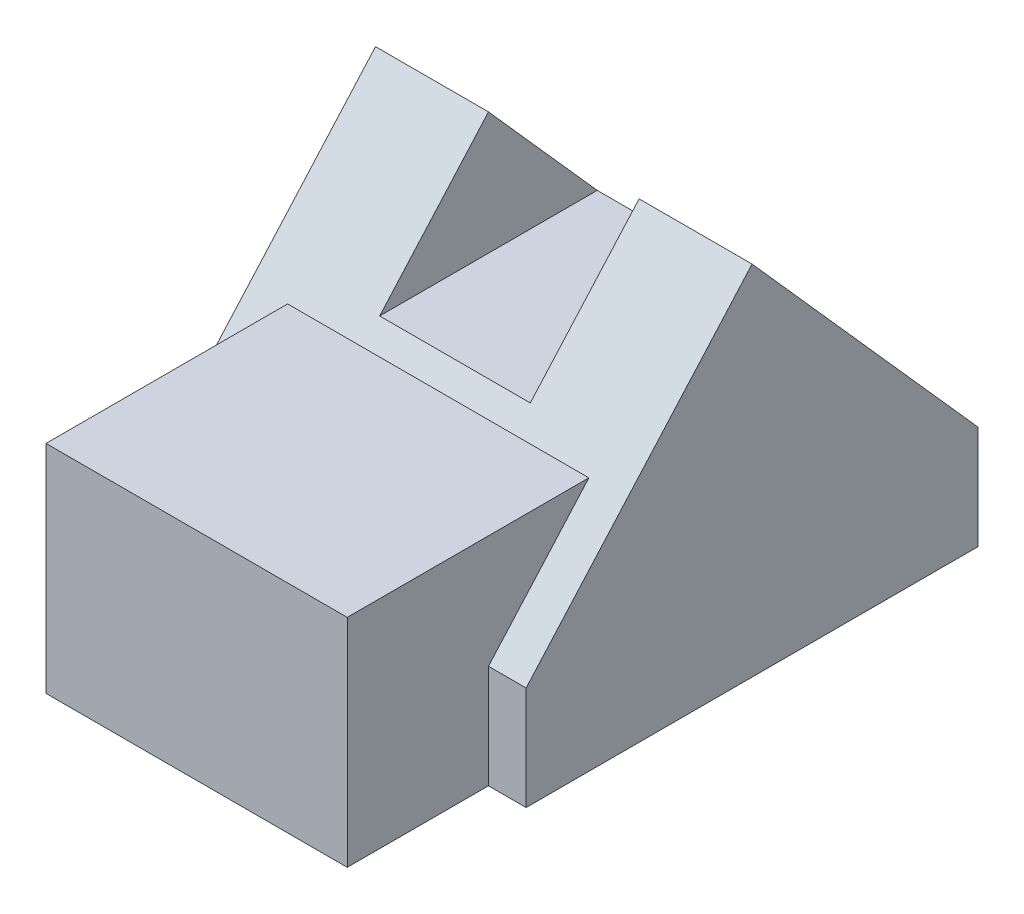
ISO-10303-21;
HEADER;
FILE_DESCRIPTION(('STEP AP214'),'2;1');
FILE_NAME('part.step','',(''),(''),'','','');
FILE_SCHEMA(('AUTOMOTIVE_DESIGN { 1 0 10303 214 1 1 1 1 }'));
ENDSEC;
DATA;
#1=APPLICATION_CONTEXT('core data for automotive mechanical design processes');
#2=APPLICATION_PROTOCOL_DEFINITION('international standard','automotive_design',2000,#1);
#3=PRODUCT_CONTEXT('',#1,'mechanical');
#4=PRODUCT('Part','Part','',(#3));
#5=PRODUCT_RELATED_PRODUCT_CATEGORY('part','',(#4));
#6=PRODUCT_DEFINITION_FORMATION('','',#4);
#7=PRODUCT_DEFINITION_CONTEXT('part definition',#1,'design');
#8=PRODUCT_DEFINITION('design','',#6,#7);
#9=PRODUCT_DEFINITION_SHAPE('','',#8);
#10=(LENGTH_UNIT() NAMED_UNIT(*) SI_UNIT(.MILLI.,.METRE.));
#11=(NAMED_UNIT(*) PLANE_ANGLE_UNIT() SI_UNIT($,.RADIAN.));
#12=(NAMED_UNIT(*) SI_UNIT($,.STERADIAN.) SOLID_ANGLE_UNIT());
#13=UNCERTAINTY_MEASURE_WITH_UNIT(LENGTH_MEASURE(1.E-05),#10,'distance_accuracy_value','');
#14=(GEOMETRIC_REPRESENTATION_CONTEXT(3) GLOBAL_UNCERTAINTY_ASSIGNED_CONTEXT((#13)) GLOBAL_UNIT_ASSIGNED_CONTEXT((#10,
#11,#12)) REPRESENTATION_CONTEXT('',''));
#15=CARTESIAN_POINT('',(0.,0.,0.));
#16=DIRECTION('',(0.,0.,1.));
#17=DIRECTION('',(1.,0.,0.));
#18=AXIS2_PLACEMENT_3D('',#15,#16,#17);
#19=CARTESIAN_POINT('',(0.,38.,0.));
#20=DIRECTION('',(1.,0.,0.));
#21=DIRECTION('',(0.,0.,-1.));
#22=AXIS2_PLACEMENT_3D('',#19,#20,#21);
#23=PLANE('',#22);
#24=DIRECTION('',(0.,1.,0.));
#25=VECTOR('',#24,1.);
#26=CARTESIAN_POINT('',(0.,0.,-15.));
#27=LINE('',#26,#25);
#28=CARTESIAN_POINT('',(0.,0.,-15.));
#29=VERTEX_POINT('',#28);
#30=CARTESIAN_POINT('',(0.,11.,-15.));
#31=VERTEX_POINT('',#30);
#32=EDGE_CURVE('E157',#29,#31,#27,.T.);
#33=ORIENTED_EDGE('',*,*,#32,.T.);
#34=DIRECTION('',(0.,0.74740931868366,-0.66436383882992));
#35=VECTOR('',#34,1.);
#36=CARTESIAN_POINT('',(0.,23.,-25.6666666666667));
#37=LINE('',#36,#35);
#38=CARTESIAN_POINT('',(0.,38.,-39.));
#39=VERTEX_POINT('',#38);
#40=EDGE_CURVE('E150',#31,#39,#37,.T.);
#41=ORIENTED_EDGE('',*,*,#40,.T.);
#42=DIRECTION('',(0.,0.74740931868366,0.66436383882992));
#43=VECTOR('',#42,1.);
#44=CARTESIAN_POINT('',(0.,57.3655172413793,-21.7862068965517));
#45=LINE('',#44,#43);
#46=CARTESIAN_POINT('',(0.,11.,-63.));
#47=VERTEX_POINT('',#46);
#48=EDGE_CURVE('E248',#47,#39,#45,.T.);
#49=ORIENTED_EDGE('',*,*,#48,.F.);
#50=DIRECTION('',(0.,-1.,0.));
#51=VECTOR('',#50,1.);
#52=CARTESIAN_POINT('',(0.,38.,-63.));
#53=LINE('',#52,#51);
#54=CARTESIAN_POINT('',(0.,0.,-63.));
#55=VERTEX_POINT('',#54);
#56=EDGE_CURVE('E204',#47,#55,#53,.T.);
#57=ORIENTED_EDGE('',*,*,#56,.T.);
#58=DIRECTION('',(0.,0.,1.));
#59=VECTOR('',#58,1.);
#60=CARTESIAN_POINT('',(0.,0.,0.));
#61=LINE('',#60,#59);
#62=EDGE_CURVE('E162',#55,#29,#61,.T.);
#63=ORIENTED_EDGE('',*,*,#62,.T.);
#64=EDGE_LOOP('',(#33,#41,#49,#57,#63));
#65=FACE_BOUND('',#64,.T.);
#66=ADVANCED_FACE('F39',(#65),#23,.F.);
#67=CARTESIAN_POINT('',(0.,0.,-15.));
#68=DIRECTION('',(0.,0.,-1.));
#69=DIRECTION('',(-1.,0.,0.));
#70=AXIS2_PLACEMENT_3D('',#67,#68,#69);
#71=PLANE('',#70);
#72=DIRECTION('',(-1.,0.,0.));
#73=VECTOR('',#72,1.);
#74=CARTESIAN_POINT('',(4.,11.,-15.));
#75=LINE('',#74,#73);
#76=CARTESIAN_POINT('',(4.,11.,-15.));
#77=VERTEX_POINT('',#76);
#78=EDGE_CURVE('E145',#77,#31,#75,.T.);
#79=ORIENTED_EDGE('',*,*,#78,.T.);
#80=ORIENTED_EDGE('',*,*,#32,.F.);
#81=DIRECTION('',(-1.,0.,0.));
#82=VECTOR('',#81,1.);
#83=CARTESIAN_POINT('',(0.,0.,-15.));
#84=LINE('',#83,#82);
#85=CARTESIAN_POINT('',(4.,0.,-15.));
#86=VERTEX_POINT('',#85);
#87=EDGE_CURVE('E62',#86,#29,#84,.T.);
#88=ORIENTED_EDGE('',*,*,#87,.F.);
#89=DIRECTION('',(0.,1.,0.));
#90=VECTOR('',#89,1.);
#91=CARTESIAN_POINT('',(4.,0.,-15.));
#92=LINE('',#91,#90);
#93=EDGE_CURVE('E138',#86,#77,#92,.T.);
#94=ORIENTED_EDGE('',*,*,#93,.T.);
#95=EDGE_LOOP('',(#79,#80,#88,#94));
#96=FACE_BOUND('',#95,.T.);
#97=ADVANCED_FACE('F155',(#96),#71,.F.);
#98=CARTESIAN_POINT('',(0.,38.,0.));
#99=DIRECTION('',(0.,0.,-1.));
#100=DIRECTION('',(-1.,0.,0.));
#101=AXIS2_PLACEMENT_3D('',#98,#99,#100);
#102=PLANE('',#101);
#103=DIRECTION('',(0.,1.,0.));
#104=VECTOR('',#103,1.);
#105=CARTESIAN_POINT('',(36.,0.,0.));
#106=LINE('',#105,#104);
#107=CARTESIAN_POINT('',(36.,0.,0.));
#108=VERTEX_POINT('',#107);
#109=CARTESIAN_POINT('',(36.,23.,0.));
#110=VERTEX_POINT('',#109);
#111=EDGE_CURVE('E177',#108,#110,#106,.T.);
#112=ORIENTED_EDGE('',*,*,#111,.T.);
#113=DIRECTION('',(1.,0.,0.));
#114=VECTOR('',#113,1.);
#115=CARTESIAN_POINT('',(0.,23.,0.));
#116=LINE('',#115,#114);
#117=CARTESIAN_POINT('',(4.,23.,0.));
#118=VERTEX_POINT('',#117);
#119=EDGE_CURVE('E269',#118,#110,#116,.T.);
#120=ORIENTED_EDGE('',*,*,#119,.F.);
#121=DIRECTION('',(0.,1.,0.));
#122=VECTOR('',#121,1.);
#123=CARTESIAN_POINT('',(4.,0.,0.));
#124=LINE('',#123,#122);
#125=CARTESIAN_POINT('',(4.,0.,0.));
#126=VERTEX_POINT('',#125);
#127=EDGE_CURVE('E158',#126,#118,#124,.T.);
#128=ORIENTED_EDGE('',*,*,#127,.F.);
#129=DIRECTION('',(1.,0.,0.));
#130=VECTOR('',#129,1.);
#131=CARTESIAN_POINT('',(0.,0.,0.));
#132=LINE('',#131,#130);
#133=EDGE_CURVE('E192',#126,#108,#132,.T.);
#134=ORIENTED_EDGE('',*,*,#133,.T.);
#135=EDGE_LOOP('',(#112,#120,#128,#134));
#136=FACE_BOUND('',#135,.T.);
#137=ADVANCED_FACE('F266',(#136),#102,.F.);
#138=CARTESIAN_POINT('',(40.,38.,0.));
#139=DIRECTION('',(-1.,0.,0.));
#140=DIRECTION('',(0.,0.,1.));
#141=AXIS2_PLACEMENT_3D('',#138,#139,#140);
#142=PLANE('',#141);
#143=DIRECTION('',(0.,-1.,0.));
#144=VECTOR('',#143,1.);
#145=CARTESIAN_POINT('',(40.,38.,-63.));
#146=LINE('',#145,#144);
#147=CARTESIAN_POINT('',(40.,11.,-63.));
#148=VERTEX_POINT('',#147);
#149=CARTESIAN_POINT('',(40.,0.,-63.));
#150=VERTEX_POINT('',#149);
#151=EDGE_CURVE('E207',#148,#150,#146,.T.);
#152=ORIENTED_EDGE('',*,*,#151,.F.);
#153=DIRECTION('',(0.,-0.74740931868366,-0.66436383882992));
#154=VECTOR('',#153,1.);
#155=CARTESIAN_POINT('',(40.,36.1379310344828,-40.6551724137931));
#156=LINE('',#155,#154);
#157=CARTESIAN_POINT('',(40.,38.,-39.));
#158=VERTEX_POINT('',#157);
#159=EDGE_CURVE('E288',#158,#148,#156,.T.);
#160=ORIENTED_EDGE('',*,*,#159,.F.);
#161=DIRECTION('',(0.,0.74740931868366,-0.66436383882992));
#162=VECTOR('',#161,1.);
#163=CARTESIAN_POINT('',(40.,-2.59310344827586,-2.91724137931034));
#164=LINE('',#163,#162);
#165=CARTESIAN_POINT('',(40.,11.,-15.));
#166=VERTEX_POINT('',#165);
#167=EDGE_CURVE('E226',#166,#158,#164,.T.);
#168=ORIENTED_EDGE('',*,*,#167,.F.);
#169=DIRECTION('',(0.,1.,0.));
#170=VECTOR('',#169,1.);
#171=CARTESIAN_POINT('',(40.,0.,-15.));
#172=LINE('',#171,#170);
#173=CARTESIAN_POINT('',(40.,0.,-15.));
#174=VERTEX_POINT('',#173);
#175=EDGE_CURVE('E176',#174,#166,#172,.T.);
#176=ORIENTED_EDGE('',*,*,#175,.F.);
#177=DIRECTION('',(0.,0.,-1.));
#178=VECTOR('',#177,1.);
#179=CARTESIAN_POINT('',(40.,0.,0.));
#180=LINE('',#179,#178);
#181=EDGE_CURVE('E196',#174,#150,#180,.T.);
#182=ORIENTED_EDGE('',*,*,#181,.T.);
#183=EDGE_LOOP('',(#152,#160,#168,#176,#182));
#184=FACE_BOUND('',#183,.T.);
#185=ADVANCED_FACE('F256',(#184),#142,.F.);
#186=CARTESIAN_POINT('',(0.,38.,-63.));
#187=DIRECTION('',(0.,0.,1.));
#188=DIRECTION('',(1.,0.,0.));
#189=AXIS2_PLACEMENT_3D('',#186,#187,#188);
#190=PLANE('',#189);
#191=ORIENTED_EDGE('',*,*,#56,.F.);
#192=DIRECTION('',(1.,0.,0.));
#193=VECTOR('',#192,1.);
#194=CARTESIAN_POINT('',(36.,11.,-63.));
#195=LINE('',#194,#193);
#196=EDGE_CURVE('E290',#47,#148,#195,.T.);
#197=ORIENTED_EDGE('',*,*,#196,.T.);
#198=ORIENTED_EDGE('',*,*,#151,.T.);
#199=DIRECTION('',(-1.,0.,0.));
#200=VECTOR('',#199,1.);
#201=CARTESIAN_POINT('',(0.,0.,-63.));
#202=LINE('',#201,#200);
#203=EDGE_CURVE('E200',#150,#55,#202,.T.);
#204=ORIENTED_EDGE('',*,*,#203,.T.);
#205=EDGE_LOOP('',(#191,#197,#198,#204));
#206=FACE_BOUND('',#205,.T.);
#207=ADVANCED_FACE('F251',(#206),#190,.F.);
#208=CARTESIAN_POINT('',(0.,0.,0.));
#209=DIRECTION('',(0.,-1.,0.));
#210=DIRECTION('',(0.,0.,-1.));
#211=AXIS2_PLACEMENT_3D('',#208,#209,#210);
#212=PLANE('',#211);
#213=ORIENTED_EDGE('',*,*,#87,.T.);
#214=ORIENTED_EDGE('',*,*,#62,.F.);
#215=ORIENTED_EDGE('',*,*,#203,.F.);
#216=ORIENTED_EDGE('',*,*,#181,.F.);
#217=DIRECTION('',(-1.,0.,0.));
#218=VECTOR('',#217,1.);
#219=CARTESIAN_POINT('',(40.,0.,-15.));
#220=LINE('',#219,#218);
#221=CARTESIAN_POINT('',(36.,0.,-15.));
#222=VERTEX_POINT('',#221);
#223=EDGE_CURVE('E167',#174,#222,#220,.T.);
#224=ORIENTED_EDGE('',*,*,#223,.T.);
#225=DIRECTION('',(0.,0.,1.));
#226=VECTOR('',#225,1.);
#227=CARTESIAN_POINT('',(36.,0.,-15.));
#228=LINE('',#227,#226);
#229=EDGE_CURVE('E171',#222,#108,#228,.T.);
#230=ORIENTED_EDGE('',*,*,#229,.T.);
#231=ORIENTED_EDGE('',*,*,#133,.F.);
#232=DIRECTION('',(0.,0.,-1.));
#233=VECTOR('',#232,1.);
#234=CARTESIAN_POINT('',(4.,0.,-15.));
#235=LINE('',#234,#233);
#236=EDGE_CURVE('E181',#126,#86,#235,.T.);
#237=ORIENTED_EDGE('',*,*,#236,.T.);
#238=EDGE_LOOP('',(#213,#214,#215,#216,#224,#230,#231,#237));
#239=FACE_BOUND('',#238,.T.);
#240=ADVANCED_FACE('F241',(#239),#212,.T.);
#241=CARTESIAN_POINT('',(36.,0.,-15.));
#242=DIRECTION('',(-1.,0.,0.));
#243=DIRECTION('',(0.,0.,1.));
#244=AXIS2_PLACEMENT_3D('',#241,#242,#243);
#245=PLANE('',#244);
#246=DIRECTION('',(0.,1.,0.));
#247=VECTOR('',#246,1.);
#248=CARTESIAN_POINT('',(36.,0.,-15.));
#249=LINE('',#248,#247);
#250=CARTESIAN_POINT('',(36.,11.,-15.));
#251=VERTEX_POINT('',#250);
#252=EDGE_CURVE('E182',#222,#251,#249,.T.);
#253=ORIENTED_EDGE('',*,*,#252,.T.);
#254=DIRECTION('',(0.,-0.74740931868366,0.66436383882992));
#255=VECTOR('',#254,1.);
#256=CARTESIAN_POINT('',(36.,23.,-25.6666666666667));
#257=LINE('',#256,#255);
#258=CARTESIAN_POINT('',(36.,23.,-25.6666666666667));
#259=VERTEX_POINT('',#258);
#260=EDGE_CURVE('E153',#259,#251,#257,.T.);
#261=ORIENTED_EDGE('',*,*,#260,.F.);
#262=DIRECTION('',(0.,0.,1.));
#263=VECTOR('',#262,1.);
#264=CARTESIAN_POINT('',(36.,23.,-15.));
#265=LINE('',#264,#263);
#266=EDGE_CURVE('E276',#259,#110,#265,.T.);
#267=ORIENTED_EDGE('',*,*,#266,.T.);
#268=ORIENTED_EDGE('',*,*,#111,.F.);
#269=ORIENTED_EDGE('',*,*,#229,.F.);
#270=EDGE_LOOP('',(#253,#261,#267,#268,#269));
#271=FACE_BOUND('',#270,.T.);
#272=ADVANCED_FACE('F263',(#271),#245,.F.);
#273=CARTESIAN_POINT('',(40.,0.,-15.));
#274=DIRECTION('',(0.,0.,-1.));
#275=DIRECTION('',(-1.,0.,0.));
#276=AXIS2_PLACEMENT_3D('',#273,#274,#275);
#277=PLANE('',#276);
#278=ORIENTED_EDGE('',*,*,#175,.T.);
#279=DIRECTION('',(1.,0.,0.));
#280=VECTOR('',#279,1.);
#281=CARTESIAN_POINT('',(36.,11.,-15.));
#282=LINE('',#281,#280);
#283=EDGE_CURVE('E228',#251,#166,#282,.T.);
#284=ORIENTED_EDGE('',*,*,#283,.F.);
#285=ORIENTED_EDGE('',*,*,#252,.F.);
#286=ORIENTED_EDGE('',*,*,#223,.F.);
#287=EDGE_LOOP('',(#278,#284,#285,#286));
#288=FACE_BOUND('',#287,.T.);
#289=ADVANCED_FACE('F259',(#288),#277,.F.);
#290=CARTESIAN_POINT('',(4.,0.,-15.));
#291=DIRECTION('',(1.,0.,0.));
#292=DIRECTION('',(0.,0.,-1.));
#293=AXIS2_PLACEMENT_3D('',#290,#291,#292);
#294=PLANE('',#293);
#295=ORIENTED_EDGE('',*,*,#127,.T.);
#296=DIRECTION('',(0.,0.,-1.));
#297=VECTOR('',#296,1.);
#298=CARTESIAN_POINT('',(4.,23.,-15.));
#299=LINE('',#298,#297);
#300=CARTESIAN_POINT('',(4.,23.,-25.6666666666667));
#301=VERTEX_POINT('',#300);
#302=EDGE_CURVE('E140',#118,#301,#299,.T.);
#303=ORIENTED_EDGE('',*,*,#302,.T.);
#304=DIRECTION('',(0.,0.74740931868366,-0.66436383882992));
#305=VECTOR('',#304,1.);
#306=CARTESIAN_POINT('',(4.,11.,-15.));
#307=LINE('',#306,#305);
#308=EDGE_CURVE('E134',#77,#301,#307,.T.);
#309=ORIENTED_EDGE('',*,*,#308,.F.);
#310=ORIENTED_EDGE('',*,*,#93,.F.);
#311=ORIENTED_EDGE('',*,*,#236,.F.);
#312=EDGE_LOOP('',(#295,#303,#309,#310,#311));
#313=FACE_BOUND('',#312,.T.);
#314=ADVANCED_FACE('F137',(#313),#294,.F.);
#315=CARTESIAN_POINT('',(36.,-2.59310344827586,-2.91724137931034));
#316=DIRECTION('',(0.,-0.66436383882992,-0.74740931868366));
#317=DIRECTION('',(0.,0.74740931868366,-0.66436383882992));
#318=AXIS2_PLACEMENT_3D('',#315,#316,#317);
#319=PLANE('',#318);
#320=ORIENTED_EDGE('',*,*,#40,.F.);
#321=ORIENTED_EDGE('',*,*,#78,.F.);
#322=ORIENTED_EDGE('',*,*,#308,.T.);
#323=DIRECTION('',(-1.,0.,0.));
#324=VECTOR('',#323,1.);
#325=CARTESIAN_POINT('',(36.,23.,-25.6666666666667));
#326=LINE('',#325,#324);
#327=EDGE_CURVE('E301',#259,#301,#326,.T.);
#328=ORIENTED_EDGE('',*,*,#327,.F.);
#329=ORIENTED_EDGE('',*,*,#260,.T.);
#330=ORIENTED_EDGE('',*,*,#283,.T.);
#331=ORIENTED_EDGE('',*,*,#167,.T.);
#332=DIRECTION('',(1.,0.,0.));
#333=VECTOR('',#332,1.);
#334=CARTESIAN_POINT('',(36.,38.,-39.));
#335=LINE('',#334,#333);
#336=CARTESIAN_POINT('',(28.,38.,-39.));
#337=VERTEX_POINT('',#336);
#338=EDGE_CURVE('E219',#337,#158,#335,.T.);
#339=ORIENTED_EDGE('',*,*,#338,.F.);
#340=DIRECTION('',(0.,-0.74740931868366,0.66436383882992));
#341=VECTOR('',#340,1.);
#342=CARTESIAN_POINT('',(28.,-2.59310344827586,-2.91724137931034));
#343=LINE('',#342,#341);
#344=CARTESIAN_POINT('',(28.,25.,-27.4444444444445));
#345=VERTEX_POINT('',#344);
#346=EDGE_CURVE('E224',#337,#345,#343,.T.);
#347=ORIENTED_EDGE('',*,*,#346,.T.);
#348=DIRECTION('',(-1.,0.,0.));
#349=VECTOR('',#348,1.);
#350=CARTESIAN_POINT('',(36.,25.,-27.4444444444445));
#351=LINE('',#350,#349);
#352=CARTESIAN_POINT('',(12.,25.,-27.4444444444445));
#353=VERTEX_POINT('',#352);
#354=EDGE_CURVE('E293',#345,#353,#351,.T.);
#355=ORIENTED_EDGE('',*,*,#354,.T.);
#356=DIRECTION('',(0.,0.74740931868366,-0.66436383882992));
#357=VECTOR('',#356,1.);
#358=CARTESIAN_POINT('',(12.,-2.59310344827586,-2.91724137931034));
#359=LINE('',#358,#357);
#360=CARTESIAN_POINT('',(12.,38.,-39.));
#361=VERTEX_POINT('',#360);
#362=EDGE_CURVE('E272',#353,#361,#359,.T.);
#363=ORIENTED_EDGE('',*,*,#362,.T.);
#364=EDGE_CURVE('E172',#39,#361,#335,.T.);
#365=ORIENTED_EDGE('',*,*,#364,.F.);
#366=EDGE_LOOP('',(#320,#321,#322,#328,#329,#330,#331,#339,#347,#355,#363,#365));
#367=FACE_BOUND('',#366,.T.);
#368=ADVANCED_FACE('F148',(#367),#319,.F.);
#369=CARTESIAN_POINT('',(36.,36.1379310344828,-40.6551724137931));
#370=DIRECTION('',(0.,-0.66436383882992,0.74740931868366));
#371=DIRECTION('',(0.,-0.74740931868366,-0.66436383882992));
#372=AXIS2_PLACEMENT_3D('',#369,#370,#371);
#373=PLANE('',#372);
#374=ORIENTED_EDGE('',*,*,#196,.F.);
#375=ORIENTED_EDGE('',*,*,#48,.T.);
#376=ORIENTED_EDGE('',*,*,#364,.T.);
#377=DIRECTION('',(0.,-0.74740931868366,-0.66436383882992));
#378=VECTOR('',#377,1.);
#379=CARTESIAN_POINT('',(12.,36.1379310344828,-40.6551724137931));
#380=LINE('',#379,#378);
#381=CARTESIAN_POINT('',(12.,25.,-50.5555555555556));
#382=VERTEX_POINT('',#381);
#383=EDGE_CURVE('E11',#361,#382,#380,.T.);
#384=ORIENTED_EDGE('',*,*,#383,.T.);
#385=DIRECTION('',(1.,0.,0.));
#386=VECTOR('',#385,1.);
#387=CARTESIAN_POINT('',(36.,25.,-50.5555555555556));
#388=LINE('',#387,#386);
#389=CARTESIAN_POINT('',(28.,25.,-50.5555555555556));
#390=VERTEX_POINT('',#389);
#391=EDGE_CURVE('E210',#382,#390,#388,.T.);
#392=ORIENTED_EDGE('',*,*,#391,.T.);
#393=DIRECTION('',(0.,0.74740931868366,0.66436383882992));
#394=VECTOR('',#393,1.);
#395=CARTESIAN_POINT('',(28.,36.1379310344828,-40.6551724137931));
#396=LINE('',#395,#394);
#397=EDGE_CURVE('E47',#390,#337,#396,.T.);
#398=ORIENTED_EDGE('',*,*,#397,.T.);
#399=ORIENTED_EDGE('',*,*,#338,.T.);
#400=ORIENTED_EDGE('',*,*,#159,.T.);
#401=EDGE_LOOP('',(#374,#375,#376,#384,#392,#398,#399,#400));
#402=FACE_BOUND('',#401,.T.);
#403=ADVANCED_FACE('F218',(#402),#373,.F.);
#404=CARTESIAN_POINT('',(0.,23.,-25.6666666666667));
#405=DIRECTION('',(0.,-1.,0.));
#406=DIRECTION('',(0.,0.,-1.));
#407=AXIS2_PLACEMENT_3D('',#404,#405,#406);
#408=PLANE('',#407);
#409=ORIENTED_EDGE('',*,*,#327,.T.);
#410=ORIENTED_EDGE('',*,*,#302,.F.);
#411=ORIENTED_EDGE('',*,*,#119,.T.);
#412=ORIENTED_EDGE('',*,*,#266,.F.);
#413=EDGE_LOOP('',(#409,#410,#411,#412));
#414=FACE_BOUND('',#413,.T.);
#415=ADVANCED_FACE('F312',(#414),#408,.F.);
#416=CARTESIAN_POINT('',(12.,38.,-72.));
#417=DIRECTION('',(-1.,0.,0.));
#418=DIRECTION('',(0.,-1.,0.));
#419=AXIS2_PLACEMENT_3D('',#416,#417,#418);
#420=PLANE('',#419);
#421=DIRECTION('',(0.,0.,1.));
#422=VECTOR('',#421,1.);
#423=CARTESIAN_POINT('',(12.,25.,-72.));
#424=LINE('',#423,#422);
#425=EDGE_CURVE('E298',#382,#353,#424,.T.);
#426=ORIENTED_EDGE('',*,*,#425,.F.);
#427=ORIENTED_EDGE('',*,*,#383,.F.);
#428=ORIENTED_EDGE('',*,*,#362,.F.);
#429=EDGE_LOOP('',(#426,#427,#428));
#430=FACE_BOUND('',#429,.T.);
#431=ADVANCED_FACE('F297',(#430),#420,.F.);
#432=CARTESIAN_POINT('',(28.,25.,-72.));
#433=DIRECTION('',(1.,0.,0.));
#434=DIRECTION('',(0.,0.,-1.));
#435=AXIS2_PLACEMENT_3D('',#432,#433,#434);
#436=PLANE('',#435);
#437=ORIENTED_EDGE('',*,*,#397,.F.);
#438=DIRECTION('',(0.,0.,1.));
#439=VECTOR('',#438,1.);
#440=CARTESIAN_POINT('',(28.,25.,-72.));
#441=LINE('',#440,#439);
#442=EDGE_CURVE('E54',#390,#345,#441,.T.);
#443=ORIENTED_EDGE('',*,*,#442,.T.);
#444=ORIENTED_EDGE('',*,*,#346,.F.);
#445=EDGE_LOOP('',(#437,#443,#444));
#446=FACE_BOUND('',#445,.T.);
#447=ADVANCED_FACE('F319',(#446),#436,.F.);
#448=CARTESIAN_POINT('',(12.,25.,-72.));
#449=DIRECTION('',(0.,-1.,0.));
#450=DIRECTION('',(0.,0.,-1.));
#451=AXIS2_PLACEMENT_3D('',#448,#449,#450);
#452=PLANE('',#451);
#453=ORIENTED_EDGE('',*,*,#442,.F.);
#454=ORIENTED_EDGE('',*,*,#391,.F.);
#455=ORIENTED_EDGE('',*,*,#425,.T.);
#456=ORIENTED_EDGE('',*,*,#354,.F.);
#457=EDGE_LOOP('',(#453,#454,#455,#456));
#458=FACE_BOUND('',#457,.T.);
#459=ADVANCED_FACE('F299',(#458),#452,.F.);
#460=CLOSED_SHELL('',(#66,#97,#137,#185,#207,#240,#272,#289,#314,#368,#403,#415,#431,#447,#459));
#461=MANIFOLD_SOLID_BREP('B2',#460);
#462=ADVANCED_BREP_SHAPE_REPRESENTATION('',(#18,#461),#14);
#463=SHAPE_DEFINITION_REPRESENTATION(#9,#462);
ENDSEC;
END-ISO-10303-21;
